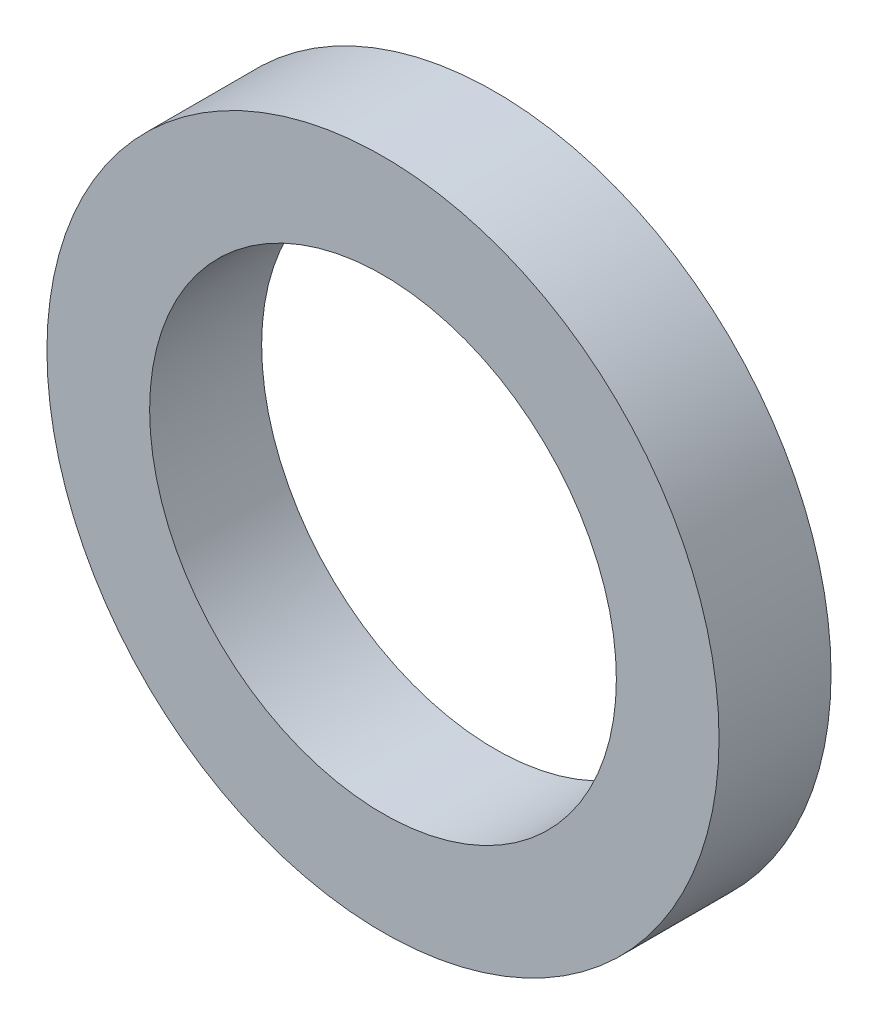
ISO-10303-21;
HEADER;
FILE_DESCRIPTION(('STEP AP214'),'2;1');
FILE_NAME('part.step','',(''),(''),'','','');
FILE_SCHEMA(('AUTOMOTIVE_DESIGN { 1 0 10303 214 1 1 1 1 }'));
ENDSEC;
DATA;
#1=APPLICATION_CONTEXT('core data for automotive mechanical design processes');
#2=APPLICATION_PROTOCOL_DEFINITION('international standard','automotive_design',2000,#1);
#3=PRODUCT_CONTEXT('',#1,'mechanical');
#4=PRODUCT('Part','Part','',(#3));
#5=PRODUCT_RELATED_PRODUCT_CATEGORY('part','',(#4));
#6=PRODUCT_DEFINITION_FORMATION('','',#4);
#7=PRODUCT_DEFINITION_CONTEXT('part definition',#1,'design');
#8=PRODUCT_DEFINITION('design','',#6,#7);
#9=PRODUCT_DEFINITION_SHAPE('','',#8);
#10=(LENGTH_UNIT() NAMED_UNIT(*) SI_UNIT(.MILLI.,.METRE.));
#11=(NAMED_UNIT(*) PLANE_ANGLE_UNIT() SI_UNIT($,.RADIAN.));
#12=(NAMED_UNIT(*) SI_UNIT($,.STERADIAN.) SOLID_ANGLE_UNIT());
#13=UNCERTAINTY_MEASURE_WITH_UNIT(LENGTH_MEASURE(1.E-05),#10,'distance_accuracy_value','');
#14=(GEOMETRIC_REPRESENTATION_CONTEXT(3) GLOBAL_UNCERTAINTY_ASSIGNED_CONTEXT((#13)) GLOBAL_UNIT_ASSIGNED_CONTEXT((#10,
#11,#12)) REPRESENTATION_CONTEXT('',''));
#15=CARTESIAN_POINT('',(0.,0.,0.));
#16=DIRECTION('',(0.,0.,1.));
#17=DIRECTION('',(1.,0.,0.));
#18=AXIS2_PLACEMENT_3D('',#15,#16,#17);
#19=CARTESIAN_POINT('',(0.,0.,3.));
#20=DIRECTION('',(0.,0.,1.));
#21=DIRECTION('',(1.,0.,0.));
#22=AXIS2_PLACEMENT_3D('',#19,#20,#21);
#23=PLANE('',#22);
#24=CARTESIAN_POINT('',(0.,0.,3.));
#25=DIRECTION('',(0.,0.,1.));
#26=DIRECTION('',(1.,0.,0.));
#27=AXIS2_PLACEMENT_3D('',#24,#25,#26);
#28=CIRCLE('',#27,9.);
#29=CARTESIAN_POINT('',(9.,0.,3.));
#30=VERTEX_POINT('',#29);
#31=EDGE_CURVE('E10',#30,#30,#28,.T.);
#32=ORIENTED_EDGE('',*,*,#31,.T.);
#33=EDGE_LOOP('',(#32));
#34=FACE_BOUND('',#33,.T.);
#35=CARTESIAN_POINT('',(0.,0.,3.));
#36=DIRECTION('',(0.,0.,1.));
#37=DIRECTION('',(1.,0.,0.));
#38=AXIS2_PLACEMENT_3D('',#35,#36,#37);
#39=CIRCLE('',#38,6.25);
#40=CARTESIAN_POINT('',(6.25,0.,3.));
#41=VERTEX_POINT('',#40);
#42=EDGE_CURVE('E43',#41,#41,#39,.T.);
#43=ORIENTED_EDGE('',*,*,#42,.F.);
#44=EDGE_LOOP('',(#43));
#45=FACE_BOUND('',#44,.T.);
#46=ADVANCED_FACE('F32',(#34,#45),#23,.T.);
#47=CARTESIAN_POINT('',(0.,0.,0.));
#48=DIRECTION('',(0.,0.,1.));
#49=DIRECTION('',(1.,0.,0.));
#50=AXIS2_PLACEMENT_3D('',#47,#48,#49);
#51=PLANE('',#50);
#52=CARTESIAN_POINT('',(0.,0.,0.));
#53=DIRECTION('',(0.,0.,1.));
#54=DIRECTION('',(1.,0.,0.));
#55=AXIS2_PLACEMENT_3D('',#52,#53,#54);
#56=CIRCLE('',#55,9.);
#57=CARTESIAN_POINT('',(9.,0.,0.));
#58=VERTEX_POINT('',#57);
#59=EDGE_CURVE('E36',#58,#58,#56,.T.);
#60=ORIENTED_EDGE('',*,*,#59,.F.);
#61=EDGE_LOOP('',(#60));
#62=FACE_BOUND('',#61,.T.);
#63=CARTESIAN_POINT('',(0.,0.,0.));
#64=DIRECTION('',(0.,0.,1.));
#65=DIRECTION('',(1.,0.,0.));
#66=AXIS2_PLACEMENT_3D('',#63,#64,#65);
#67=CIRCLE('',#66,6.25);
#68=CARTESIAN_POINT('',(6.25,0.,0.));
#69=VERTEX_POINT('',#68);
#70=EDGE_CURVE('E45',#69,#69,#67,.T.);
#71=ORIENTED_EDGE('',*,*,#70,.T.);
#72=EDGE_LOOP('',(#71));
#73=FACE_BOUND('',#72,.T.);
#74=ADVANCED_FACE('F55',(#62,#73),#51,.F.);
#75=CARTESIAN_POINT('',(0.,0.,3.));
#76=DIRECTION('',(0.,0.,-1.));
#77=DIRECTION('',(-1.,0.,0.));
#78=AXIS2_PLACEMENT_3D('',#75,#76,#77);
#79=CYLINDRICAL_SURFACE('',#78,9.);
#80=ORIENTED_EDGE('',*,*,#31,.F.);
#81=EDGE_LOOP('',(#80));
#82=FACE_BOUND('',#81,.T.);
#83=ORIENTED_EDGE('',*,*,#59,.T.);
#84=EDGE_LOOP('',(#83));
#85=FACE_BOUND('',#84,.T.);
#86=ADVANCED_FACE('F34',(#82,#85),#79,.T.);
#87=CARTESIAN_POINT('',(0.,0.,3.));
#88=DIRECTION('',(0.,0.,-1.));
#89=DIRECTION('',(-1.,0.,0.));
#90=AXIS2_PLACEMENT_3D('',#87,#88,#89);
#91=CYLINDRICAL_SURFACE('',#90,6.25);
#92=ORIENTED_EDGE('',*,*,#42,.T.);
#93=EDGE_LOOP('',(#92));
#94=FACE_BOUND('',#93,.T.);
#95=ORIENTED_EDGE('',*,*,#70,.F.);
#96=EDGE_LOOP('',(#95));
#97=FACE_BOUND('',#96,.T.);
#98=ADVANCED_FACE('F51',(#94,#97),#91,.F.);
#99=CLOSED_SHELL('',(#46,#74,#86,#98));
#100=MANIFOLD_SOLID_BREP('B2',#99);
#101=ADVANCED_BREP_SHAPE_REPRESENTATION('',(#18,#100),#14);
#102=SHAPE_DEFINITION_REPRESENTATION(#9,#101);
ENDSEC;
END-ISO-10303-21;
